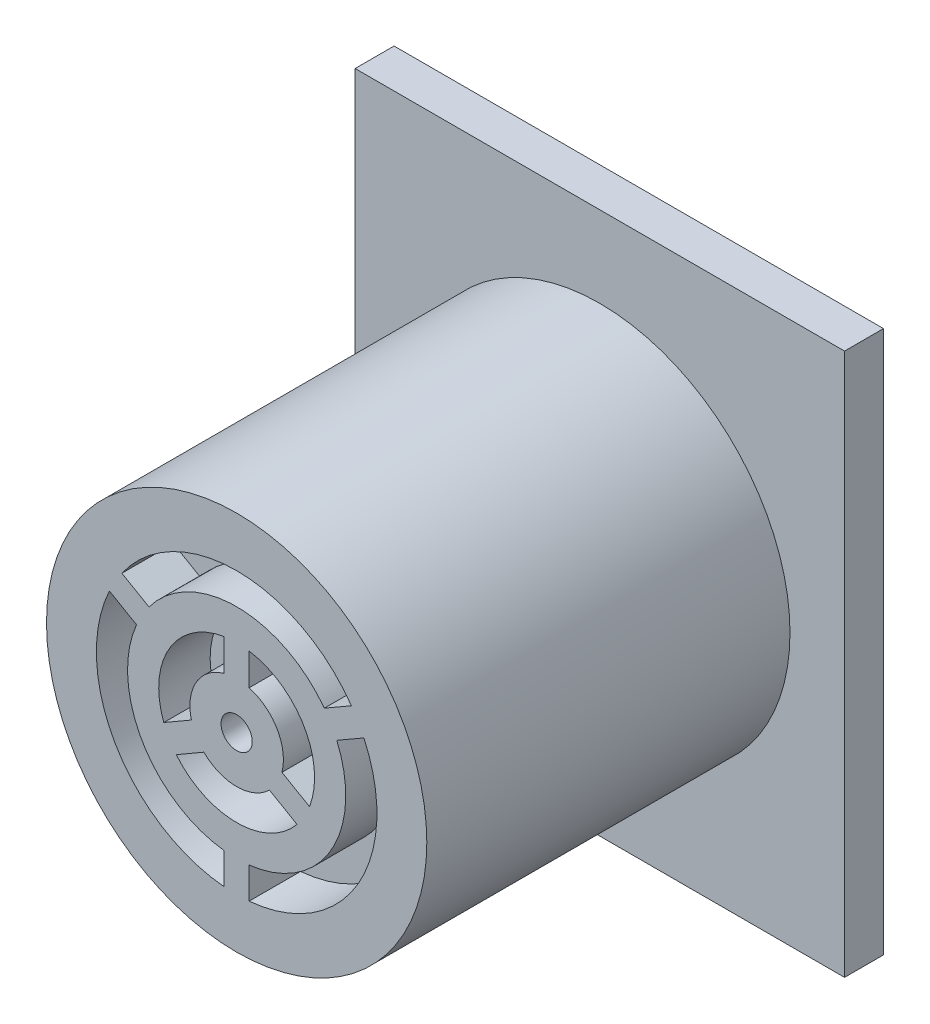
ISO-10303-21;
HEADER;
FILE_DESCRIPTION(('STEP AP214'),'2;1');
FILE_NAME('part.step','',(''),(''),'','','');
FILE_SCHEMA(('AUTOMOTIVE_DESIGN { 1 0 10303 214 1 1 1 1 }'));
ENDSEC;
DATA;
#1=APPLICATION_CONTEXT('core data for automotive mechanical design processes');
#2=APPLICATION_PROTOCOL_DEFINITION('international standard','automotive_design',2000,#1);
#3=PRODUCT_CONTEXT('',#1,'mechanical');
#4=PRODUCT('Part','Part','',(#3));
#5=PRODUCT_RELATED_PRODUCT_CATEGORY('part','',(#4));
#6=PRODUCT_DEFINITION_FORMATION('','',#4);
#7=PRODUCT_DEFINITION_CONTEXT('part definition',#1,'design');
#8=PRODUCT_DEFINITION('design','',#6,#7);
#9=PRODUCT_DEFINITION_SHAPE('','',#8);
#10=(LENGTH_UNIT() NAMED_UNIT(*) SI_UNIT(.MILLI.,.METRE.));
#11=(NAMED_UNIT(*) PLANE_ANGLE_UNIT() SI_UNIT($,.RADIAN.));
#12=(NAMED_UNIT(*) SI_UNIT($,.STERADIAN.) SOLID_ANGLE_UNIT());
#13=UNCERTAINTY_MEASURE_WITH_UNIT(LENGTH_MEASURE(1.E-05),#10,'distance_accuracy_value','');
#14=(GEOMETRIC_REPRESENTATION_CONTEXT(3) GLOBAL_UNCERTAINTY_ASSIGNED_CONTEXT((#13)) GLOBAL_UNIT_ASSIGNED_CONTEXT((#10,
#11,#12)) REPRESENTATION_CONTEXT('',''));
#15=CARTESIAN_POINT('',(0.,0.,0.));
#16=DIRECTION('',(0.,0.,1.));
#17=DIRECTION('',(1.,0.,0.));
#18=AXIS2_PLACEMENT_3D('',#15,#16,#17);
#19=CARTESIAN_POINT('',(0.,0.,16.383));
#20=DIRECTION('',(0.,0.,1.));
#21=DIRECTION('',(1.,0.,0.));
#22=AXIS2_PLACEMENT_3D('',#19,#20,#21);
#23=PLANE('',#22);
#24=CARTESIAN_POINT('',(0.,0.,16.383));
#25=DIRECTION('',(0.,0.,1.));
#26=DIRECTION('',(1.,0.,0.));
#27=AXIS2_PLACEMENT_3D('',#24,#25,#26);
#28=CIRCLE('',#27,7.747);
#29=CARTESIAN_POINT('',(7.747,0.,16.383));
#30=VERTEX_POINT('',#29);
#31=EDGE_CURVE('E13',#30,#30,#28,.T.);
#32=ORIENTED_EDGE('',*,*,#31,.T.);
#33=EDGE_LOOP('',(#32));
#34=FACE_BOUND('',#33,.T.);
#35=DIRECTION('',(0.866025403784437,0.500000000000003,0.));
#36=VECTOR('',#35,1.);
#37=CARTESIAN_POINT('',(-7.69524592699946,-3.85626443393688,16.383));
#38=LINE('',#37,#36);
#39=CARTESIAN_POINT('',(3.57026081092803,2.64787891376315,16.383));
#40=VERTEX_POINT('',#39);
#41=CARTESIAN_POINT('',(4.67574347709898,3.28612962866141,16.383));
#42=VERTEX_POINT('',#41);
#43=EDGE_CURVE('E561',#40,#42,#38,.T.);
#44=ORIENTED_EDGE('',*,*,#43,.F.);
#45=CARTESIAN_POINT('',(0.,0.,16.383));
#46=DIRECTION('',(0.,0.,1.));
#47=DIRECTION('',(1.,0.,0.));
#48=AXIS2_PLACEMENT_3D('',#45,#46,#47);
#49=CIRCLE('',#48,4.445);
#50=CARTESIAN_POINT('',(-3.57026081092802,2.64787891376316,16.383));
#51=VERTEX_POINT('',#50);
#52=EDGE_CURVE('E572',#40,#51,#49,.T.);
#53=ORIENTED_EDGE('',*,*,#52,.T.);
#54=DIRECTION('',(-0.866025403784435,0.500000000000006,0.));
#55=VECTOR('',#54,1.);
#56=CARTESIAN_POINT('',(7.69524592699949,-3.85626443393695,16.383));
#57=LINE('',#56,#55);
#58=CARTESIAN_POINT('',(-4.67574347709896,3.28612962866143,16.383));
#59=VERTEX_POINT('',#58);
#60=EDGE_CURVE('E584',#51,#59,#57,.T.);
#61=ORIENTED_EDGE('',*,*,#60,.T.);
#62=CARTESIAN_POINT('',(0.,0.,16.383));
#63=DIRECTION('',(0.,0.,1.));
#64=DIRECTION('',(1.,0.,0.));
#65=AXIS2_PLACEMENT_3D('',#62,#63,#64);
#66=CIRCLE('',#65,5.715);
#67=EDGE_CURVE('E581',#42,#59,#66,.T.);
#68=ORIENTED_EDGE('',*,*,#67,.F.);
#69=EDGE_LOOP('',(#44,#53,#61,#68));
#70=FACE_BOUND('',#69,.T.);
#71=DIRECTION('',(-0.866025403784435,0.500000000000006,0.));
#72=VECTOR('',#71,1.);
#73=CARTESIAN_POINT('',(7.18724592699949,-4.73614624418192,16.383));
#74=LINE('',#73,#72);
#75=CARTESIAN_POINT('',(-4.07826081092803,1.76799710351818,16.383));
#76=VERTEX_POINT('',#75);
#77=CARTESIAN_POINT('',(-5.18374347709897,2.40624781841644,16.383));
#78=VERTEX_POINT('',#77);
#79=EDGE_CURVE('E531',#76,#78,#74,.T.);
#80=ORIENTED_EDGE('',*,*,#79,.F.);
#81=CARTESIAN_POINT('',(0.,0.,16.383));
#82=DIRECTION('',(0.,0.,1.));
#83=DIRECTION('',(1.,0.,0.));
#84=AXIS2_PLACEMENT_3D('',#81,#82,#83);
#85=CIRCLE('',#84,4.445);
#86=CARTESIAN_POINT('',(-0.508000000000007,-4.41587601728128,16.383));
#87=VERTEX_POINT('',#86);
#88=EDGE_CURVE('E542',#76,#87,#85,.T.);
#89=ORIENTED_EDGE('',*,*,#88,.T.);
#90=DIRECTION('',(0.,-1.,0.));
#91=VECTOR('',#90,1.);
#92=CARTESIAN_POINT('',(-0.508000000000032,-17.1848213562373,16.383));
#93=LINE('',#92,#91);
#94=CARTESIAN_POINT('',(-0.50800000000001,-5.6923774470778,16.383));
#95=VERTEX_POINT('',#94);
#96=EDGE_CURVE('E554',#87,#95,#93,.T.);
#97=ORIENTED_EDGE('',*,*,#96,.T.);
#98=CARTESIAN_POINT('',(0.,0.,16.383));
#99=DIRECTION('',(0.,0.,1.));
#100=DIRECTION('',(1.,0.,0.));
#101=AXIS2_PLACEMENT_3D('',#98,#99,#100);
#102=CIRCLE('',#101,5.715);
#103=EDGE_CURVE('E551',#78,#95,#102,.T.);
#104=ORIENTED_EDGE('',*,*,#103,.F.);
#105=EDGE_LOOP('',(#80,#89,#97,#104));
#106=FACE_BOUND('',#105,.T.);
#107=DIRECTION('',(0.,1.,0.));
#108=VECTOR('',#107,1.);
#109=CARTESIAN_POINT('',(-0.508,-17.1848213562373,16.383));
#110=LINE('',#109,#108);
#111=CARTESIAN_POINT('',(-0.508,1.83601770143972,16.383));
#112=VERTEX_POINT('',#111);
#113=CARTESIAN_POINT('',(-0.508,3.13409652053028,16.383));
#114=VERTEX_POINT('',#113);
#115=EDGE_CURVE('E501',#112,#114,#110,.T.);
#116=ORIENTED_EDGE('',*,*,#115,.F.);
#117=CARTESIAN_POINT('',(0.,0.,16.383));
#118=DIRECTION('',(0.,0.,1.));
#119=DIRECTION('',(1.,0.,0.));
#120=AXIS2_PLACEMENT_3D('',#117,#118,#119);
#121=CIRCLE('',#120,1.905);
#122=CARTESIAN_POINT('',(-1.84403797124472,-0.47806794559735,16.383));
#123=VERTEX_POINT('',#122);
#124=EDGE_CURVE('E512',#112,#123,#121,.T.);
#125=ORIENTED_EDGE('',*,*,#124,.T.);
#126=DIRECTION('',(-0.866025403784439,-0.5,0.));
#127=VECTOR('',#126,1.);
#128=CARTESIAN_POINT('',(-7.69524592699944,-3.85626443393682,16.383));
#129=LINE('',#128,#127);
#130=CARTESIAN_POINT('',(-2.96820720469165,-1.12710735514263,16.383));
#131=VERTEX_POINT('',#130);
#132=EDGE_CURVE('E524',#123,#131,#129,.T.);
#133=ORIENTED_EDGE('',*,*,#132,.T.);
#134=CARTESIAN_POINT('',(0.,0.,16.383));
#135=DIRECTION('',(0.,0.,1.));
#136=DIRECTION('',(1.,0.,0.));
#137=AXIS2_PLACEMENT_3D('',#134,#135,#136);
#138=CIRCLE('',#137,3.175);
#139=EDGE_CURVE('E521',#114,#131,#138,.T.);
#140=ORIENTED_EDGE('',*,*,#139,.F.);
#141=EDGE_LOOP('',(#116,#125,#133,#140));
#142=FACE_BOUND('',#141,.T.);
#143=DIRECTION('',(-0.866025403784438,-0.5,0.));
#144=VECTOR('',#143,1.);
#145=CARTESIAN_POINT('',(-7.18724592699944,-4.73614624418181,16.383));
#146=LINE('',#145,#144);
#147=CARTESIAN_POINT('',(-1.33603797124473,-1.35794975584234,16.383));
#148=VERTEX_POINT('',#147);
#149=CARTESIAN_POINT('',(-2.46020720469165,-2.00698916538762,16.383));
#150=VERTEX_POINT('',#149);
#151=EDGE_CURVE('E475',#148,#150,#146,.T.);
#152=ORIENTED_EDGE('',*,*,#151,.F.);
#153=CARTESIAN_POINT('',(0.,0.,16.383));
#154=DIRECTION('',(0.,0.,1.));
#155=DIRECTION('',(1.,0.,0.));
#156=AXIS2_PLACEMENT_3D('',#153,#154,#155);
#157=CIRCLE('',#156,1.905);
#158=CARTESIAN_POINT('',(1.33603797124471,-1.35794975584236,16.383));
#159=VERTEX_POINT('',#158);
#160=EDGE_CURVE('E482',#148,#159,#157,.T.);
#161=ORIENTED_EDGE('',*,*,#160,.T.);
#162=DIRECTION('',(0.866025403784439,-0.5,0.));
#163=VECTOR('',#162,1.);
#164=CARTESIAN_POINT('',(7.18724592699943,-4.73614624418183,16.383));
#165=LINE('',#164,#163);
#166=CARTESIAN_POINT('',(2.46020720469163,-2.00698916538764,16.383));
#167=VERTEX_POINT('',#166);
#168=EDGE_CURVE('E494',#159,#167,#165,.T.);
#169=ORIENTED_EDGE('',*,*,#168,.T.);
#170=CARTESIAN_POINT('',(0.,0.,16.383));
#171=DIRECTION('',(0.,0.,1.));
#172=DIRECTION('',(1.,0.,0.));
#173=AXIS2_PLACEMENT_3D('',#170,#171,#172);
#174=CIRCLE('',#173,3.175);
#175=EDGE_CURVE('E491',#150,#167,#174,.T.);
#176=ORIENTED_EDGE('',*,*,#175,.F.);
#177=EDGE_LOOP('',(#152,#161,#169,#176));
#178=FACE_BOUND('',#177,.T.);
#179=CARTESIAN_POINT('',(0.,0.,16.383));
#180=DIRECTION('',(0.,0.,1.));
#181=DIRECTION('',(1.,0.,0.));
#182=AXIS2_PLACEMENT_3D('',#179,#180,#181);
#183=CIRCLE('',#182,0.635);
#184=CARTESIAN_POINT('',(0.635,0.,16.383));
#185=VERTEX_POINT('',#184);
#186=EDGE_CURVE('E466',#185,#185,#183,.T.);
#187=ORIENTED_EDGE('',*,*,#186,.F.);
#188=EDGE_LOOP('',(#187));
#189=FACE_BOUND('',#188,.T.);
#190=DIRECTION('',(0.866025403784439,-0.5,0.));
#191=VECTOR('',#190,1.);
#192=CARTESIAN_POINT('',(7.69524592699943,-3.85626443393684,16.383));
#193=LINE('',#192,#191);
#194=CARTESIAN_POINT('',(1.84403797124471,-0.478067945597378,16.383));
#195=VERTEX_POINT('',#194);
#196=CARTESIAN_POINT('',(2.96820720469163,-1.12710735514266,16.383));
#197=VERTEX_POINT('',#196);
#198=EDGE_CURVE('E267',#195,#197,#193,.T.);
#199=ORIENTED_EDGE('',*,*,#198,.F.);
#200=CARTESIAN_POINT('',(0.,0.,16.383));
#201=DIRECTION('',(0.,0.,1.));
#202=DIRECTION('',(1.,0.,0.));
#203=AXIS2_PLACEMENT_3D('',#200,#201,#202);
#204=CIRCLE('',#203,1.905);
#205=CARTESIAN_POINT('',(0.508,1.83601770143972,16.383));
#206=VERTEX_POINT('',#205);
#207=EDGE_CURVE('E447',#195,#206,#204,.T.);
#208=ORIENTED_EDGE('',*,*,#207,.T.);
#209=DIRECTION('',(0.,1.,0.));
#210=VECTOR('',#209,1.);
#211=CARTESIAN_POINT('',(0.508,-17.1848213562373,16.383));
#212=LINE('',#211,#210);
#213=CARTESIAN_POINT('',(0.508,3.13409652053028,16.383));
#214=VERTEX_POINT('',#213);
#215=EDGE_CURVE('E459',#206,#214,#212,.T.);
#216=ORIENTED_EDGE('',*,*,#215,.T.);
#217=CARTESIAN_POINT('',(0.,0.,16.383));
#218=DIRECTION('',(0.,0.,1.));
#219=DIRECTION('',(1.,0.,0.));
#220=AXIS2_PLACEMENT_3D('',#217,#218,#219);
#221=CIRCLE('',#220,3.175);
#222=EDGE_CURVE('E456',#197,#214,#221,.T.);
#223=ORIENTED_EDGE('',*,*,#222,.F.);
#224=EDGE_LOOP('',(#199,#208,#216,#223));
#225=FACE_BOUND('',#224,.T.);
#226=DIRECTION('',(0.,-1.,0.));
#227=VECTOR('',#226,1.);
#228=CARTESIAN_POINT('',(0.50799999999997,-17.1848213562373,16.383));
#229=LINE('',#228,#227);
#230=CARTESIAN_POINT('',(0.507999999999993,-4.41587601728128,16.383));
#231=VERTEX_POINT('',#230);
#232=CARTESIAN_POINT('',(0.507999999999991,-5.6923774470778,16.383));
#233=VERTEX_POINT('',#232);
#234=EDGE_CURVE('E431',#231,#233,#229,.T.);
#235=ORIENTED_EDGE('',*,*,#234,.F.);
#236=CARTESIAN_POINT('',(0.,0.,16.383));
#237=DIRECTION('',(0.,0.,1.));
#238=DIRECTION('',(1.,0.,0.));
#239=AXIS2_PLACEMENT_3D('',#236,#237,#238);
#240=CIRCLE('',#239,4.445);
#241=CARTESIAN_POINT('',(4.07826081092804,1.76799710351816,16.383));
#242=VERTEX_POINT('',#241);
#243=EDGE_CURVE('E259',#231,#242,#240,.T.);
#244=ORIENTED_EDGE('',*,*,#243,.T.);
#245=DIRECTION('',(0.866025403784437,0.500000000000002,0.));
#246=VECTOR('',#245,1.);
#247=CARTESIAN_POINT('',(-7.18724592699945,-4.73614624418186,16.383));
#248=LINE('',#247,#246);
#249=CARTESIAN_POINT('',(5.18374347709898,2.40624781841642,16.383));
#250=VERTEX_POINT('',#249);
#251=EDGE_CURVE('E421',#242,#250,#248,.T.);
#252=ORIENTED_EDGE('',*,*,#251,.T.);
#253=CARTESIAN_POINT('',(0.,0.,16.383));
#254=DIRECTION('',(0.,0.,1.));
#255=DIRECTION('',(1.,0.,0.));
#256=AXIS2_PLACEMENT_3D('',#253,#254,#255);
#257=CIRCLE('',#256,5.715);
#258=EDGE_CURVE('E433',#233,#250,#257,.T.);
#259=ORIENTED_EDGE('',*,*,#258,.F.);
#260=EDGE_LOOP('',(#235,#244,#252,#259));
#261=FACE_BOUND('',#260,.T.);
#262=ADVANCED_FACE('F244',(#34,#70,#106,#142,#178,#189,#225,#261),#23,.T.);
#263=CARTESIAN_POINT('',(0.,0.,16.383));
#264=DIRECTION('',(0.,0.,-1.));
#265=DIRECTION('',(-1.,0.,0.));
#266=AXIS2_PLACEMENT_3D('',#263,#264,#265);
#267=CYLINDRICAL_SURFACE('',#266,7.747);
#268=ORIENTED_EDGE('',*,*,#31,.F.);
#269=EDGE_LOOP('',(#268));
#270=FACE_BOUND('',#269,.T.);
#271=CARTESIAN_POINT('',(0.,0.,1.5875));
#272=DIRECTION('',(0.,0.,1.));
#273=DIRECTION('',(1.,0.,0.));
#274=AXIS2_PLACEMENT_3D('',#271,#272,#273);
#275=CIRCLE('',#274,7.747);
#276=CARTESIAN_POINT('',(7.747,0.,1.5875));
#277=VERTEX_POINT('',#276);
#278=EDGE_CURVE('E248',#277,#277,#275,.T.);
#279=ORIENTED_EDGE('',*,*,#278,.T.);
#280=EDGE_LOOP('',(#279));
#281=FACE_BOUND('',#280,.T.);
#282=ADVANCED_FACE('F246',(#270,#281),#267,.T.);
#283=CARTESIAN_POINT('',(0.,0.,1.5875));
#284=DIRECTION('',(0.,0.,1.));
#285=DIRECTION('',(1.,0.,0.));
#286=AXIS2_PLACEMENT_3D('',#283,#284,#285);
#287=PLANE('',#286);
#288=ORIENTED_EDGE('',*,*,#278,.F.);
#289=EDGE_LOOP('',(#288));
#290=FACE_BOUND('',#289,.T.);
#291=ADVANCED_FACE('F625',(#290),#287,.F.);
#292=CARTESIAN_POINT('',(-7.69524592699946,-3.85626443393688,14.2875));
#293=DIRECTION('',(0.500000000000003,-0.866025403784437,0.));
#294=DIRECTION('',(0.866025403784437,0.500000000000003,0.));
#295=AXIS2_PLACEMENT_3D('',#292,#293,#294);
#296=PLANE('',#295);
#297=ORIENTED_EDGE('',*,*,#43,.T.);
#298=DIRECTION('',(0.,0.,1.));
#299=VECTOR('',#298,1.);
#300=CARTESIAN_POINT('',(4.67574347709898,3.28612962866141,14.2875));
#301=LINE('',#300,#299);
#302=CARTESIAN_POINT('',(4.67574347709898,3.28612962866141,14.2875));
#303=VERTEX_POINT('',#302);
#304=EDGE_CURVE('E579',#303,#42,#301,.T.);
#305=ORIENTED_EDGE('',*,*,#304,.F.);
#306=DIRECTION('',(0.866025403784437,0.500000000000003,0.));
#307=VECTOR('',#306,1.);
#308=CARTESIAN_POINT('',(-7.69524592699946,-3.85626443393688,14.2875));
#309=LINE('',#308,#307);
#310=CARTESIAN_POINT('',(3.57026081092803,2.64787891376315,14.2875));
#311=VERTEX_POINT('',#310);
#312=EDGE_CURVE('E568',#311,#303,#309,.T.);
#313=ORIENTED_EDGE('',*,*,#312,.F.);
#314=DIRECTION('',(0.,0.,1.));
#315=VECTOR('',#314,1.);
#316=CARTESIAN_POINT('',(3.57026081092803,2.64787891376315,14.2875));
#317=LINE('',#316,#315);
#318=EDGE_CURVE('E589',#311,#40,#317,.T.);
#319=ORIENTED_EDGE('',*,*,#318,.T.);
#320=EDGE_LOOP('',(#297,#305,#313,#319));
#321=FACE_BOUND('',#320,.T.);
#322=ADVANCED_FACE('F615',(#321),#296,.F.);
#323=CARTESIAN_POINT('',(0.,0.,14.2875));
#324=DIRECTION('',(0.,0.,1.));
#325=DIRECTION('',(1.,0.,0.));
#326=AXIS2_PLACEMENT_3D('',#323,#324,#325);
#327=CYLINDRICAL_SURFACE('',#326,4.445);
#328=ORIENTED_EDGE('',*,*,#52,.F.);
#329=ORIENTED_EDGE('',*,*,#318,.F.);
#330=CARTESIAN_POINT('',(0.,0.,14.2875));
#331=DIRECTION('',(0.,0.,1.));
#332=DIRECTION('',(1.,0.,0.));
#333=AXIS2_PLACEMENT_3D('',#330,#331,#332);
#334=CIRCLE('',#333,4.445);
#335=CARTESIAN_POINT('',(-3.57026081092802,2.64787891376316,14.2875));
#336=VERTEX_POINT('',#335);
#337=EDGE_CURVE('E577',#311,#336,#334,.T.);
#338=ORIENTED_EDGE('',*,*,#337,.T.);
#339=DIRECTION('',(0.,0.,1.));
#340=VECTOR('',#339,1.);
#341=CARTESIAN_POINT('',(-3.57026081092802,2.64787891376316,14.2875));
#342=LINE('',#341,#340);
#343=EDGE_CURVE('E591',#336,#51,#342,.T.);
#344=ORIENTED_EDGE('',*,*,#343,.T.);
#345=EDGE_LOOP('',(#328,#329,#338,#344));
#346=FACE_BOUND('',#345,.T.);
#347=ADVANCED_FACE('F617',(#346),#327,.T.);
#348=CARTESIAN_POINT('',(7.69524592699949,-3.85626443393695,14.2875));
#349=DIRECTION('',(0.500000000000006,0.866025403784435,0.));
#350=DIRECTION('',(-0.866025403784435,0.500000000000006,0.));
#351=AXIS2_PLACEMENT_3D('',#348,#349,#350);
#352=PLANE('',#351);
#353=ORIENTED_EDGE('',*,*,#60,.F.);
#354=ORIENTED_EDGE('',*,*,#343,.F.);
#355=DIRECTION('',(-0.866025403784435,0.500000000000006,0.));
#356=VECTOR('',#355,1.);
#357=CARTESIAN_POINT('',(7.69524592699949,-3.85626443393695,14.2875));
#358=LINE('',#357,#356);
#359=CARTESIAN_POINT('',(-4.67574347709896,3.28612962866143,14.2875));
#360=VERTEX_POINT('',#359);
#361=EDGE_CURVE('E575',#336,#360,#358,.T.);
#362=ORIENTED_EDGE('',*,*,#361,.T.);
#363=DIRECTION('',(0.,0.,1.));
#364=VECTOR('',#363,1.);
#365=CARTESIAN_POINT('',(-4.67574347709896,3.28612962866143,14.2875));
#366=LINE('',#365,#364);
#367=EDGE_CURVE('E593',#360,#59,#366,.T.);
#368=ORIENTED_EDGE('',*,*,#367,.T.);
#369=EDGE_LOOP('',(#353,#354,#362,#368));
#370=FACE_BOUND('',#369,.T.);
#371=ADVANCED_FACE('F610',(#370),#352,.T.);
#372=CARTESIAN_POINT('',(0.,0.,14.2875));
#373=DIRECTION('',(0.,0.,1.));
#374=DIRECTION('',(1.,0.,0.));
#375=AXIS2_PLACEMENT_3D('',#372,#373,#374);
#376=CYLINDRICAL_SURFACE('',#375,5.715);
#377=ORIENTED_EDGE('',*,*,#67,.T.);
#378=ORIENTED_EDGE('',*,*,#367,.F.);
#379=CARTESIAN_POINT('',(0.,0.,14.2875));
#380=DIRECTION('',(0.,0.,1.));
#381=DIRECTION('',(1.,0.,0.));
#382=AXIS2_PLACEMENT_3D('',#379,#380,#381);
#383=CIRCLE('',#382,5.715);
#384=EDGE_CURVE('E571',#303,#360,#383,.T.);
#385=ORIENTED_EDGE('',*,*,#384,.F.);
#386=ORIENTED_EDGE('',*,*,#304,.T.);
#387=EDGE_LOOP('',(#377,#378,#385,#386));
#388=FACE_BOUND('',#387,.T.);
#389=ADVANCED_FACE('F599',(#388),#376,.F.);
#390=CARTESIAN_POINT('',(0.,-17.1848213562373,14.2875));
#391=DIRECTION('',(0.,0.,1.));
#392=DIRECTION('',(1.,0.,0.));
#393=AXIS2_PLACEMENT_3D('',#390,#391,#392);
#394=PLANE('',#393);
#395=ORIENTED_EDGE('',*,*,#312,.T.);
#396=ORIENTED_EDGE('',*,*,#384,.T.);
#397=ORIENTED_EDGE('',*,*,#361,.F.);
#398=ORIENTED_EDGE('',*,*,#337,.F.);
#399=EDGE_LOOP('',(#395,#396,#397,#398));
#400=FACE_BOUND('',#399,.T.);
#401=ADVANCED_FACE('F613',(#400),#394,.T.);
#402=CARTESIAN_POINT('',(7.18724592699949,-4.73614624418192,14.2875));
#403=DIRECTION('',(0.500000000000006,0.866025403784435,0.));
#404=DIRECTION('',(-0.866025403784435,0.500000000000006,0.));
#405=AXIS2_PLACEMENT_3D('',#402,#403,#404);
#406=PLANE('',#405);
#407=ORIENTED_EDGE('',*,*,#79,.T.);
#408=DIRECTION('',(0.,0.,1.));
#409=VECTOR('',#408,1.);
#410=CARTESIAN_POINT('',(-5.18374347709897,2.40624781841644,14.2875));
#411=LINE('',#410,#409);
#412=CARTESIAN_POINT('',(-5.18374347709897,2.40624781841644,14.2875));
#413=VERTEX_POINT('',#412);
#414=EDGE_CURVE('E549',#413,#78,#411,.T.);
#415=ORIENTED_EDGE('',*,*,#414,.F.);
#416=DIRECTION('',(-0.866025403784435,0.500000000000006,0.));
#417=VECTOR('',#416,1.);
#418=CARTESIAN_POINT('',(7.18724592699949,-4.73614624418192,14.2875));
#419=LINE('',#418,#417);
#420=CARTESIAN_POINT('',(-4.07826081092803,1.76799710351818,14.2875));
#421=VERTEX_POINT('',#420);
#422=EDGE_CURVE('E538',#421,#413,#419,.T.);
#423=ORIENTED_EDGE('',*,*,#422,.F.);
#424=DIRECTION('',(0.,0.,1.));
#425=VECTOR('',#424,1.);
#426=CARTESIAN_POINT('',(-4.07826081092803,1.76799710351818,14.2875));
#427=LINE('',#426,#425);
#428=EDGE_CURVE('E559',#421,#76,#427,.T.);
#429=ORIENTED_EDGE('',*,*,#428,.T.);
#430=EDGE_LOOP('',(#407,#415,#423,#429));
#431=FACE_BOUND('',#430,.T.);
#432=ADVANCED_FACE('F677',(#431),#406,.F.);
#433=CARTESIAN_POINT('',(0.,0.,14.2875));
#434=DIRECTION('',(0.,0.,1.));
#435=DIRECTION('',(1.,0.,0.));
#436=AXIS2_PLACEMENT_3D('',#433,#434,#435);
#437=CYLINDRICAL_SURFACE('',#436,4.445);
#438=ORIENTED_EDGE('',*,*,#88,.F.);
#439=ORIENTED_EDGE('',*,*,#428,.F.);
#440=CARTESIAN_POINT('',(0.,0.,14.2875));
#441=DIRECTION('',(0.,0.,1.));
#442=DIRECTION('',(1.,0.,0.));
#443=AXIS2_PLACEMENT_3D('',#440,#441,#442);
#444=CIRCLE('',#443,4.445);
#445=CARTESIAN_POINT('',(-0.508000000000007,-4.41587601728128,14.2875));
#446=VERTEX_POINT('',#445);
#447=EDGE_CURVE('E547',#421,#446,#444,.T.);
#448=ORIENTED_EDGE('',*,*,#447,.T.);
#449=DIRECTION('',(0.,0.,1.));
#450=VECTOR('',#449,1.);
#451=CARTESIAN_POINT('',(-0.508000000000007,-4.41587601728128,14.2875));
#452=LINE('',#451,#450);
#453=EDGE_CURVE('E562',#446,#87,#452,.T.);
#454=ORIENTED_EDGE('',*,*,#453,.T.);
#455=EDGE_LOOP('',(#438,#439,#448,#454));
#456=FACE_BOUND('',#455,.T.);
#457=ADVANCED_FACE('F685',(#456),#437,.T.);
#458=CARTESIAN_POINT('',(-0.508000000000032,-17.1848213562373,14.2875));
#459=DIRECTION('',(-1.,0.,0.));
#460=DIRECTION('',(0.,-1.,0.));
#461=AXIS2_PLACEMENT_3D('',#458,#459,#460);
#462=PLANE('',#461);
#463=ORIENTED_EDGE('',*,*,#96,.F.);
#464=ORIENTED_EDGE('',*,*,#453,.F.);
#465=DIRECTION('',(0.,-1.,0.));
#466=VECTOR('',#465,1.);
#467=CARTESIAN_POINT('',(-0.508000000000032,-17.1848213562373,14.2875));
#468=LINE('',#467,#466);
#469=CARTESIAN_POINT('',(-0.50800000000001,-5.6923774470778,14.2875));
#470=VERTEX_POINT('',#469);
#471=EDGE_CURVE('E545',#446,#470,#468,.T.);
#472=ORIENTED_EDGE('',*,*,#471,.T.);
#473=DIRECTION('',(0.,0.,1.));
#474=VECTOR('',#473,1.);
#475=CARTESIAN_POINT('',(-0.50800000000001,-5.6923774470778,14.2875));
#476=LINE('',#475,#474);
#477=EDGE_CURVE('E564',#470,#95,#476,.T.);
#478=ORIENTED_EDGE('',*,*,#477,.T.);
#479=EDGE_LOOP('',(#463,#464,#472,#478));
#480=FACE_BOUND('',#479,.T.);
#481=ADVANCED_FACE('F695',(#480),#462,.T.);
#482=CARTESIAN_POINT('',(0.,0.,14.2875));
#483=DIRECTION('',(0.,0.,1.));
#484=DIRECTION('',(1.,0.,0.));
#485=AXIS2_PLACEMENT_3D('',#482,#483,#484);
#486=CYLINDRICAL_SURFACE('',#485,5.715);
#487=ORIENTED_EDGE('',*,*,#103,.T.);
#488=ORIENTED_EDGE('',*,*,#477,.F.);
#489=CARTESIAN_POINT('',(0.,0.,14.2875));
#490=DIRECTION('',(0.,0.,1.));
#491=DIRECTION('',(1.,0.,0.));
#492=AXIS2_PLACEMENT_3D('',#489,#490,#491);
#493=CIRCLE('',#492,5.715);
#494=EDGE_CURVE('E541',#413,#470,#493,.T.);
#495=ORIENTED_EDGE('',*,*,#494,.F.);
#496=ORIENTED_EDGE('',*,*,#414,.T.);
#497=EDGE_LOOP('',(#487,#488,#495,#496));
#498=FACE_BOUND('',#497,.T.);
#499=ADVANCED_FACE('F705',(#498),#486,.F.);
#500=CARTESIAN_POINT('',(0.,-17.1848213562373,14.2875));
#501=DIRECTION('',(0.,0.,1.));
#502=DIRECTION('',(1.,0.,0.));
#503=AXIS2_PLACEMENT_3D('',#500,#501,#502);
#504=PLANE('',#503);
#505=ORIENTED_EDGE('',*,*,#422,.T.);
#506=ORIENTED_EDGE('',*,*,#494,.T.);
#507=ORIENTED_EDGE('',*,*,#471,.F.);
#508=ORIENTED_EDGE('',*,*,#447,.F.);
#509=EDGE_LOOP('',(#505,#506,#507,#508));
#510=FACE_BOUND('',#509,.T.);
#511=ADVANCED_FACE('F715',(#510),#504,.T.);
#512=CARTESIAN_POINT('',(-0.508,-17.1848213562373,14.2875));
#513=DIRECTION('',(1.,0.,0.));
#514=DIRECTION('',(0.,0.,-1.));
#515=AXIS2_PLACEMENT_3D('',#512,#513,#514);
#516=PLANE('',#515);
#517=ORIENTED_EDGE('',*,*,#115,.T.);
#518=DIRECTION('',(0.,0.,1.));
#519=VECTOR('',#518,1.);
#520=CARTESIAN_POINT('',(-0.508,3.13409652053028,14.2875));
#521=LINE('',#520,#519);
#522=CARTESIAN_POINT('',(-0.508,3.13409652053028,14.2875));
#523=VERTEX_POINT('',#522);
#524=EDGE_CURVE('E519',#523,#114,#521,.T.);
#525=ORIENTED_EDGE('',*,*,#524,.F.);
#526=DIRECTION('',(0.,1.,0.));
#527=VECTOR('',#526,1.);
#528=CARTESIAN_POINT('',(-0.508,-17.1848213562373,14.2875));
#529=LINE('',#528,#527);
#530=CARTESIAN_POINT('',(-0.508,1.83601770143972,14.2875));
#531=VERTEX_POINT('',#530);
#532=EDGE_CURVE('E508',#531,#523,#529,.T.);
#533=ORIENTED_EDGE('',*,*,#532,.F.);
#534=DIRECTION('',(0.,0.,1.));
#535=VECTOR('',#534,1.);
#536=CARTESIAN_POINT('',(-0.508,1.83601770143972,14.2875));
#537=LINE('',#536,#535);
#538=EDGE_CURVE('E529',#531,#112,#537,.T.);
#539=ORIENTED_EDGE('',*,*,#538,.T.);
#540=EDGE_LOOP('',(#517,#525,#533,#539));
#541=FACE_BOUND('',#540,.T.);
#542=ADVANCED_FACE('F725',(#541),#516,.F.);
#543=CARTESIAN_POINT('',(0.,0.,14.2875));
#544=DIRECTION('',(0.,0.,1.));
#545=DIRECTION('',(1.,0.,0.));
#546=AXIS2_PLACEMENT_3D('',#543,#544,#545);
#547=CYLINDRICAL_SURFACE('',#546,1.905);
#548=ORIENTED_EDGE('',*,*,#124,.F.);
#549=ORIENTED_EDGE('',*,*,#538,.F.);
#550=CARTESIAN_POINT('',(0.,0.,14.2875));
#551=DIRECTION('',(0.,0.,1.));
#552=DIRECTION('',(1.,0.,0.));
#553=AXIS2_PLACEMENT_3D('',#550,#551,#552);
#554=CIRCLE('',#553,1.905);
#555=CARTESIAN_POINT('',(-1.84403797124472,-0.47806794559735,14.2875));
#556=VERTEX_POINT('',#555);
#557=EDGE_CURVE('E517',#531,#556,#554,.T.);
#558=ORIENTED_EDGE('',*,*,#557,.T.);
#559=DIRECTION('',(0.,0.,1.));
#560=VECTOR('',#559,1.);
#561=CARTESIAN_POINT('',(-1.84403797124472,-0.47806794559735,14.2875));
#562=LINE('',#561,#560);
#563=EDGE_CURVE('E532',#556,#123,#562,.T.);
#564=ORIENTED_EDGE('',*,*,#563,.T.);
#565=EDGE_LOOP('',(#548,#549,#558,#564));
#566=FACE_BOUND('',#565,.T.);
#567=ADVANCED_FACE('F735',(#566),#547,.T.);
#568=CARTESIAN_POINT('',(-7.69524592699944,-3.85626443393682,14.2875));
#569=DIRECTION('',(-0.5,0.866025403784439,0.));
#570=DIRECTION('',(-0.866025403784439,-0.5,0.));
#571=AXIS2_PLACEMENT_3D('',#568,#569,#570);
#572=PLANE('',#571);
#573=ORIENTED_EDGE('',*,*,#132,.F.);
#574=ORIENTED_EDGE('',*,*,#563,.F.);
#575=DIRECTION('',(-0.866025403784439,-0.5,0.));
#576=VECTOR('',#575,1.);
#577=CARTESIAN_POINT('',(-7.69524592699944,-3.85626443393682,14.2875));
#578=LINE('',#577,#576);
#579=CARTESIAN_POINT('',(-2.96820720469165,-1.12710735514263,14.2875));
#580=VERTEX_POINT('',#579);
#581=EDGE_CURVE('E515',#556,#580,#578,.T.);
#582=ORIENTED_EDGE('',*,*,#581,.T.);
#583=DIRECTION('',(0.,0.,1.));
#584=VECTOR('',#583,1.);
#585=CARTESIAN_POINT('',(-2.96820720469165,-1.12710735514263,14.2875));
#586=LINE('',#585,#584);
#587=EDGE_CURVE('E534',#580,#131,#586,.T.);
#588=ORIENTED_EDGE('',*,*,#587,.T.);
#589=EDGE_LOOP('',(#573,#574,#582,#588));
#590=FACE_BOUND('',#589,.T.);
#591=ADVANCED_FACE('F745',(#590),#572,.T.);
#592=CARTESIAN_POINT('',(0.,0.,14.2875));
#593=DIRECTION('',(0.,0.,1.));
#594=DIRECTION('',(1.,0.,0.));
#595=AXIS2_PLACEMENT_3D('',#592,#593,#594);
#596=CYLINDRICAL_SURFACE('',#595,3.175);
#597=ORIENTED_EDGE('',*,*,#139,.T.);
#598=ORIENTED_EDGE('',*,*,#587,.F.);
#599=CARTESIAN_POINT('',(0.,0.,14.2875));
#600=DIRECTION('',(0.,0.,1.));
#601=DIRECTION('',(1.,0.,0.));
#602=AXIS2_PLACEMENT_3D('',#599,#600,#601);
#603=CIRCLE('',#602,3.175);
#604=EDGE_CURVE('E511',#523,#580,#603,.T.);
#605=ORIENTED_EDGE('',*,*,#604,.F.);
#606=ORIENTED_EDGE('',*,*,#524,.T.);
#607=EDGE_LOOP('',(#597,#598,#605,#606));
#608=FACE_BOUND('',#607,.T.);
#609=ADVANCED_FACE('F755',(#608),#596,.F.);
#610=CARTESIAN_POINT('',(0.,-17.1848213562373,14.2875));
#611=DIRECTION('',(0.,0.,1.));
#612=DIRECTION('',(1.,0.,0.));
#613=AXIS2_PLACEMENT_3D('',#610,#611,#612);
#614=PLANE('',#613);
#615=ORIENTED_EDGE('',*,*,#532,.T.);
#616=ORIENTED_EDGE('',*,*,#604,.T.);
#617=ORIENTED_EDGE('',*,*,#581,.F.);
#618=ORIENTED_EDGE('',*,*,#557,.F.);
#619=EDGE_LOOP('',(#615,#616,#617,#618));
#620=FACE_BOUND('',#619,.T.);
#621=ADVANCED_FACE('F765',(#620),#614,.T.);
#622=CARTESIAN_POINT('',(-7.18724592699944,-4.73614624418181,14.2875));
#623=DIRECTION('',(-0.5,0.866025403784438,0.));
#624=DIRECTION('',(-0.866025403784438,-0.5,0.));
#625=AXIS2_PLACEMENT_3D('',#622,#623,#624);
#626=PLANE('',#625);
#627=ORIENTED_EDGE('',*,*,#151,.T.);
#628=DIRECTION('',(0.,0.,1.));
#629=VECTOR('',#628,1.);
#630=CARTESIAN_POINT('',(-2.46020720469165,-2.00698916538762,14.2875));
#631=LINE('',#630,#629);
#632=CARTESIAN_POINT('',(-2.46020720469165,-2.00698916538762,14.2875));
#633=VERTEX_POINT('',#632);
#634=EDGE_CURVE('E489',#633,#150,#631,.T.);
#635=ORIENTED_EDGE('',*,*,#634,.F.);
#636=DIRECTION('',(-0.866025403784438,-0.5,0.));
#637=VECTOR('',#636,1.);
#638=CARTESIAN_POINT('',(-7.18724592699944,-4.73614624418181,14.2875));
#639=LINE('',#638,#637);
#640=CARTESIAN_POINT('',(-1.33603797124473,-1.35794975584234,14.2875));
#641=VERTEX_POINT('',#640);
#642=EDGE_CURVE('E478',#641,#633,#639,.T.);
#643=ORIENTED_EDGE('',*,*,#642,.F.);
#644=DIRECTION('',(0.,0.,1.));
#645=VECTOR('',#644,1.);
#646=CARTESIAN_POINT('',(-1.33603797124473,-1.35794975584234,14.2875));
#647=LINE('',#646,#645);
#648=EDGE_CURVE('E499',#641,#148,#647,.T.);
#649=ORIENTED_EDGE('',*,*,#648,.T.);
#650=EDGE_LOOP('',(#627,#635,#643,#649));
#651=FACE_BOUND('',#650,.T.);
#652=ADVANCED_FACE('F775',(#651),#626,.F.);
#653=CARTESIAN_POINT('',(0.,0.,14.2875));
#654=DIRECTION('',(0.,0.,1.));
#655=DIRECTION('',(1.,0.,0.));
#656=AXIS2_PLACEMENT_3D('',#653,#654,#655);
#657=CYLINDRICAL_SURFACE('',#656,1.905);
#658=ORIENTED_EDGE('',*,*,#160,.F.);
#659=ORIENTED_EDGE('',*,*,#648,.F.);
#660=CARTESIAN_POINT('',(0.,0.,14.2875));
#661=DIRECTION('',(0.,0.,1.));
#662=DIRECTION('',(1.,0.,0.));
#663=AXIS2_PLACEMENT_3D('',#660,#661,#662);
#664=CIRCLE('',#663,1.905);
#665=CARTESIAN_POINT('',(1.33603797124471,-1.35794975584236,14.2875));
#666=VERTEX_POINT('',#665);
#667=EDGE_CURVE('E487',#641,#666,#664,.T.);
#668=ORIENTED_EDGE('',*,*,#667,.T.);
#669=DIRECTION('',(0.,0.,1.));
#670=VECTOR('',#669,1.);
#671=CARTESIAN_POINT('',(1.33603797124471,-1.35794975584236,14.2875));
#672=LINE('',#671,#670);
#673=EDGE_CURVE('E502',#666,#159,#672,.T.);
#674=ORIENTED_EDGE('',*,*,#673,.T.);
#675=EDGE_LOOP('',(#658,#659,#668,#674));
#676=FACE_BOUND('',#675,.T.);
#677=ADVANCED_FACE('F785',(#676),#657,.T.);
#678=CARTESIAN_POINT('',(7.18724592699943,-4.73614624418183,14.2875));
#679=DIRECTION('',(-0.5,-0.866025403784439,0.));
#680=DIRECTION('',(0.866025403784439,-0.5,0.));
#681=AXIS2_PLACEMENT_3D('',#678,#679,#680);
#682=PLANE('',#681);
#683=ORIENTED_EDGE('',*,*,#168,.F.);
#684=ORIENTED_EDGE('',*,*,#673,.F.);
#685=DIRECTION('',(0.866025403784439,-0.5,0.));
#686=VECTOR('',#685,1.);
#687=CARTESIAN_POINT('',(7.18724592699943,-4.73614624418183,14.2875));
#688=LINE('',#687,#686);
#689=CARTESIAN_POINT('',(2.46020720469163,-2.00698916538764,14.2875));
#690=VERTEX_POINT('',#689);
#691=EDGE_CURVE('E485',#666,#690,#688,.T.);
#692=ORIENTED_EDGE('',*,*,#691,.T.);
#693=DIRECTION('',(0.,0.,1.));
#694=VECTOR('',#693,1.);
#695=CARTESIAN_POINT('',(2.46020720469163,-2.00698916538764,14.2875));
#696=LINE('',#695,#694);
#697=EDGE_CURVE('E504',#690,#167,#696,.T.);
#698=ORIENTED_EDGE('',*,*,#697,.T.);
#699=EDGE_LOOP('',(#683,#684,#692,#698));
#700=FACE_BOUND('',#699,.T.);
#701=ADVANCED_FACE('F795',(#700),#682,.T.);
#702=CARTESIAN_POINT('',(0.,0.,14.2875));
#703=DIRECTION('',(0.,0.,1.));
#704=DIRECTION('',(1.,0.,0.));
#705=AXIS2_PLACEMENT_3D('',#702,#703,#704);
#706=CYLINDRICAL_SURFACE('',#705,3.175);
#707=ORIENTED_EDGE('',*,*,#175,.T.);
#708=ORIENTED_EDGE('',*,*,#697,.F.);
#709=CARTESIAN_POINT('',(0.,0.,14.2875));
#710=DIRECTION('',(0.,0.,1.));
#711=DIRECTION('',(1.,0.,0.));
#712=AXIS2_PLACEMENT_3D('',#709,#710,#711);
#713=CIRCLE('',#712,3.175);
#714=EDGE_CURVE('E481',#633,#690,#713,.T.);
#715=ORIENTED_EDGE('',*,*,#714,.F.);
#716=ORIENTED_EDGE('',*,*,#634,.T.);
#717=EDGE_LOOP('',(#707,#708,#715,#716));
#718=FACE_BOUND('',#717,.T.);
#719=ADVANCED_FACE('F805',(#718),#706,.F.);
#720=CARTESIAN_POINT('',(0.,-17.1848213562373,14.2875));
#721=DIRECTION('',(0.,0.,1.));
#722=DIRECTION('',(1.,0.,0.));
#723=AXIS2_PLACEMENT_3D('',#720,#721,#722);
#724=PLANE('',#723);
#725=ORIENTED_EDGE('',*,*,#642,.T.);
#726=ORIENTED_EDGE('',*,*,#714,.T.);
#727=ORIENTED_EDGE('',*,*,#691,.F.);
#728=ORIENTED_EDGE('',*,*,#667,.F.);
#729=EDGE_LOOP('',(#725,#726,#727,#728));
#730=FACE_BOUND('',#729,.T.);
#731=ADVANCED_FACE('F815',(#730),#724,.T.);
#732=CARTESIAN_POINT('',(0.,0.,14.2875));
#733=DIRECTION('',(0.,0.,1.));
#734=DIRECTION('',(1.,0.,0.));
#735=AXIS2_PLACEMENT_3D('',#732,#733,#734);
#736=CYLINDRICAL_SURFACE('',#735,0.635);
#737=CARTESIAN_POINT('',(0.,0.,14.2875));
#738=DIRECTION('',(0.,0.,1.));
#739=DIRECTION('',(1.,0.,0.));
#740=AXIS2_PLACEMENT_3D('',#737,#738,#739);
#741=CIRCLE('',#740,0.635);
#742=CARTESIAN_POINT('',(0.635,0.,14.2875));
#743=VERTEX_POINT('',#742);
#744=EDGE_CURVE('E472',#743,#743,#741,.T.);
#745=ORIENTED_EDGE('',*,*,#744,.F.);
#746=EDGE_LOOP('',(#745));
#747=FACE_BOUND('',#746,.T.);
#748=ORIENTED_EDGE('',*,*,#186,.T.);
#749=EDGE_LOOP('',(#748));
#750=FACE_BOUND('',#749,.T.);
#751=ADVANCED_FACE('F825',(#747,#750),#736,.F.);
#752=CARTESIAN_POINT('',(0.,-17.1848213562373,14.2875));
#753=DIRECTION('',(0.,0.,1.));
#754=DIRECTION('',(1.,0.,0.));
#755=AXIS2_PLACEMENT_3D('',#752,#753,#754);
#756=PLANE('',#755);
#757=ORIENTED_EDGE('',*,*,#744,.T.);
#758=EDGE_LOOP('',(#757));
#759=FACE_BOUND('',#758,.T.);
#760=ADVANCED_FACE('F835',(#759),#756,.T.);
#761=CARTESIAN_POINT('',(7.69524592699943,-3.85626443393684,14.2875));
#762=DIRECTION('',(-0.5,-0.866025403784439,0.));
#763=DIRECTION('',(0.866025403784439,-0.5,0.));
#764=AXIS2_PLACEMENT_3D('',#761,#762,#763);
#765=PLANE('',#764);
#766=ORIENTED_EDGE('',*,*,#198,.T.);
#767=DIRECTION('',(0.,0.,1.));
#768=VECTOR('',#767,1.);
#769=CARTESIAN_POINT('',(2.96820720469164,-1.12710735514266,14.2875));
#770=LINE('',#769,#768);
#771=CARTESIAN_POINT('',(2.96820720469164,-1.12710735514266,14.2875));
#772=VERTEX_POINT('',#771);
#773=EDGE_CURVE('E454',#772,#197,#770,.T.);
#774=ORIENTED_EDGE('',*,*,#773,.F.);
#775=DIRECTION('',(0.866025403784439,-0.5,0.));
#776=VECTOR('',#775,1.);
#777=CARTESIAN_POINT('',(7.69524592699943,-3.85626443393684,14.2875));
#778=LINE('',#777,#776);
#779=CARTESIAN_POINT('',(1.84403797124471,-0.478067945597378,14.2875));
#780=VERTEX_POINT('',#779);
#781=EDGE_CURVE('E443',#780,#772,#778,.T.);
#782=ORIENTED_EDGE('',*,*,#781,.F.);
#783=DIRECTION('',(0.,0.,1.));
#784=VECTOR('',#783,1.);
#785=CARTESIAN_POINT('',(1.84403797124471,-0.478067945597378,14.2875));
#786=LINE('',#785,#784);
#787=EDGE_CURVE('E464',#780,#195,#786,.T.);
#788=ORIENTED_EDGE('',*,*,#787,.T.);
#789=EDGE_LOOP('',(#766,#774,#782,#788));
#790=FACE_BOUND('',#789,.T.);
#791=ADVANCED_FACE('F845',(#790),#765,.F.);
#792=CARTESIAN_POINT('',(0.,0.,14.2875));
#793=DIRECTION('',(0.,0.,1.));
#794=DIRECTION('',(1.,0.,0.));
#795=AXIS2_PLACEMENT_3D('',#792,#793,#794);
#796=CYLINDRICAL_SURFACE('',#795,1.905);
#797=ORIENTED_EDGE('',*,*,#207,.F.);
#798=ORIENTED_EDGE('',*,*,#787,.F.);
#799=CARTESIAN_POINT('',(0.,0.,14.2875));
#800=DIRECTION('',(0.,0.,1.));
#801=DIRECTION('',(1.,0.,0.));
#802=AXIS2_PLACEMENT_3D('',#799,#800,#801);
#803=CIRCLE('',#802,1.905);
#804=CARTESIAN_POINT('',(0.508,1.83601770143972,14.2875));
#805=VERTEX_POINT('',#804);
#806=EDGE_CURVE('E452',#780,#805,#803,.T.);
#807=ORIENTED_EDGE('',*,*,#806,.T.);
#808=DIRECTION('',(0.,0.,1.));
#809=VECTOR('',#808,1.);
#810=CARTESIAN_POINT('',(0.508,1.83601770143972,14.2875));
#811=LINE('',#810,#809);
#812=EDGE_CURVE('E467',#805,#206,#811,.T.);
#813=ORIENTED_EDGE('',*,*,#812,.T.);
#814=EDGE_LOOP('',(#797,#798,#807,#813));
#815=FACE_BOUND('',#814,.T.);
#816=ADVANCED_FACE('F855',(#815),#796,.T.);
#817=CARTESIAN_POINT('',(0.508,-17.1848213562373,14.2875));
#818=DIRECTION('',(1.,0.,0.));
#819=DIRECTION('',(0.,0.,-1.));
#820=AXIS2_PLACEMENT_3D('',#817,#818,#819);
#821=PLANE('',#820);
#822=ORIENTED_EDGE('',*,*,#215,.F.);
#823=ORIENTED_EDGE('',*,*,#812,.F.);
#824=DIRECTION('',(0.,1.,0.));
#825=VECTOR('',#824,1.);
#826=CARTESIAN_POINT('',(0.508,-17.1848213562373,14.2875));
#827=LINE('',#826,#825);
#828=CARTESIAN_POINT('',(0.508,3.13409652053028,14.2875));
#829=VERTEX_POINT('',#828);
#830=EDGE_CURVE('E450',#805,#829,#827,.T.);
#831=ORIENTED_EDGE('',*,*,#830,.T.);
#832=DIRECTION('',(0.,0.,1.));
#833=VECTOR('',#832,1.);
#834=CARTESIAN_POINT('',(0.508,3.13409652053028,14.2875));
#835=LINE('',#834,#833);
#836=EDGE_CURVE('E469',#829,#214,#835,.T.);
#837=ORIENTED_EDGE('',*,*,#836,.T.);
#838=EDGE_LOOP('',(#822,#823,#831,#837));
#839=FACE_BOUND('',#838,.T.);
#840=ADVANCED_FACE('F864',(#839),#821,.T.);
#841=CARTESIAN_POINT('',(0.,0.,14.2875));
#842=DIRECTION('',(0.,0.,1.));
#843=DIRECTION('',(1.,0.,0.));
#844=AXIS2_PLACEMENT_3D('',#841,#842,#843);
#845=CYLINDRICAL_SURFACE('',#844,3.175);
#846=ORIENTED_EDGE('',*,*,#222,.T.);
#847=ORIENTED_EDGE('',*,*,#836,.F.);
#848=CARTESIAN_POINT('',(0.,0.,14.2875));
#849=DIRECTION('',(0.,0.,1.));
#850=DIRECTION('',(1.,0.,0.));
#851=AXIS2_PLACEMENT_3D('',#848,#849,#850);
#852=CIRCLE('',#851,3.175);
#853=EDGE_CURVE('E446',#772,#829,#852,.T.);
#854=ORIENTED_EDGE('',*,*,#853,.F.);
#855=ORIENTED_EDGE('',*,*,#773,.T.);
#856=EDGE_LOOP('',(#846,#847,#854,#855));
#857=FACE_BOUND('',#856,.T.);
#858=ADVANCED_FACE('F874',(#857),#845,.F.);
#859=CARTESIAN_POINT('',(0.,-17.1848213562373,14.2875));
#860=DIRECTION('',(0.,0.,1.));
#861=DIRECTION('',(1.,0.,0.));
#862=AXIS2_PLACEMENT_3D('',#859,#860,#861);
#863=PLANE('',#862);
#864=ORIENTED_EDGE('',*,*,#781,.T.);
#865=ORIENTED_EDGE('',*,*,#853,.T.);
#866=ORIENTED_EDGE('',*,*,#830,.F.);
#867=ORIENTED_EDGE('',*,*,#806,.F.);
#868=EDGE_LOOP('',(#864,#865,#866,#867));
#869=FACE_BOUND('',#868,.T.);
#870=ADVANCED_FACE('F884',(#869),#863,.T.);
#871=CARTESIAN_POINT('',(0.,0.,14.2875));
#872=DIRECTION('',(0.,0.,1.));
#873=DIRECTION('',(1.,0.,0.));
#874=AXIS2_PLACEMENT_3D('',#871,#872,#873);
#875=CYLINDRICAL_SURFACE('',#874,4.445);
#876=ORIENTED_EDGE('',*,*,#243,.F.);
#877=DIRECTION('',(0.,0.,1.));
#878=VECTOR('',#877,1.);
#879=CARTESIAN_POINT('',(0.507999999999993,-4.41587601728128,14.2875));
#880=LINE('',#879,#878);
#881=CARTESIAN_POINT('',(0.507999999999993,-4.41587601728128,14.2875));
#882=VERTEX_POINT('',#881);
#883=EDGE_CURVE('E404',#882,#231,#880,.T.);
#884=ORIENTED_EDGE('',*,*,#883,.F.);
#885=CARTESIAN_POINT('',(0.,0.,14.2875));
#886=DIRECTION('',(0.,0.,1.));
#887=DIRECTION('',(1.,0.,0.));
#888=AXIS2_PLACEMENT_3D('',#885,#886,#887);
#889=CIRCLE('',#888,4.445);
#890=CARTESIAN_POINT('',(4.07826081092804,1.76799710351816,14.2875));
#891=VERTEX_POINT('',#890);
#892=EDGE_CURVE('E407',#882,#891,#889,.T.);
#893=ORIENTED_EDGE('',*,*,#892,.T.);
#894=DIRECTION('',(0.,0.,1.));
#895=VECTOR('',#894,1.);
#896=CARTESIAN_POINT('',(4.07826081092804,1.76799710351816,14.2875));
#897=LINE('',#896,#895);
#898=EDGE_CURVE('E438',#891,#242,#897,.T.);
#899=ORIENTED_EDGE('',*,*,#898,.T.);
#900=EDGE_LOOP('',(#876,#884,#893,#899));
#901=FACE_BOUND('',#900,.T.);
#902=ADVANCED_FACE('F406',(#901),#875,.T.);
#903=CARTESIAN_POINT('',(-7.18724592699945,-4.73614624418186,14.2875));
#904=DIRECTION('',(0.500000000000002,-0.866025403784437,0.));
#905=DIRECTION('',(0.866025403784437,0.500000000000002,0.));
#906=AXIS2_PLACEMENT_3D('',#903,#904,#905);
#907=PLANE('',#906);
#908=ORIENTED_EDGE('',*,*,#251,.F.);
#909=ORIENTED_EDGE('',*,*,#898,.F.);
#910=DIRECTION('',(0.866025403784437,0.500000000000002,0.));
#911=VECTOR('',#910,1.);
#912=CARTESIAN_POINT('',(-7.18724592699945,-4.73614624418186,14.2875));
#913=LINE('',#912,#911);
#914=CARTESIAN_POINT('',(5.18374347709898,2.40624781841642,14.2875));
#915=VERTEX_POINT('',#914);
#916=EDGE_CURVE('E414',#891,#915,#913,.T.);
#917=ORIENTED_EDGE('',*,*,#916,.T.);
#918=DIRECTION('',(0.,0.,1.));
#919=VECTOR('',#918,1.);
#920=CARTESIAN_POINT('',(5.18374347709898,2.40624781841642,14.2875));
#921=LINE('',#920,#919);
#922=EDGE_CURVE('E440',#915,#250,#921,.T.);
#923=ORIENTED_EDGE('',*,*,#922,.T.);
#924=EDGE_LOOP('',(#908,#909,#917,#923));
#925=FACE_BOUND('',#924,.T.);
#926=ADVANCED_FACE('F903',(#925),#907,.T.);
#927=CARTESIAN_POINT('',(0.,0.,14.2875));
#928=DIRECTION('',(0.,0.,1.));
#929=DIRECTION('',(1.,0.,0.));
#930=AXIS2_PLACEMENT_3D('',#927,#928,#929);
#931=CYLINDRICAL_SURFACE('',#930,5.715);
#932=ORIENTED_EDGE('',*,*,#258,.T.);
#933=ORIENTED_EDGE('',*,*,#922,.F.);
#934=CARTESIAN_POINT('',(0.,0.,14.2875));
#935=DIRECTION('',(0.,0.,1.));
#936=DIRECTION('',(1.,0.,0.));
#937=AXIS2_PLACEMENT_3D('',#934,#935,#936);
#938=CIRCLE('',#937,5.715);
#939=CARTESIAN_POINT('',(0.507999999999991,-5.6923774470778,14.2875));
#940=VERTEX_POINT('',#939);
#941=EDGE_CURVE('E425',#940,#915,#938,.T.);
#942=ORIENTED_EDGE('',*,*,#941,.F.);
#943=DIRECTION('',(0.,0.,1.));
#944=VECTOR('',#943,1.);
#945=CARTESIAN_POINT('',(0.507999999999991,-5.6923774470778,14.2875));
#946=LINE('',#945,#944);
#947=EDGE_CURVE('E413',#940,#233,#946,.T.);
#948=ORIENTED_EDGE('',*,*,#947,.T.);
#949=EDGE_LOOP('',(#932,#933,#942,#948));
#950=FACE_BOUND('',#949,.T.);
#951=ADVANCED_FACE('F912',(#950),#931,.F.);
#952=CARTESIAN_POINT('',(0.50799999999997,-17.1848213562373,14.2875));
#953=DIRECTION('',(-1.,0.,0.));
#954=DIRECTION('',(0.,-1.,0.));
#955=AXIS2_PLACEMENT_3D('',#952,#953,#954);
#956=PLANE('',#955);
#957=ORIENTED_EDGE('',*,*,#234,.T.);
#958=ORIENTED_EDGE('',*,*,#947,.F.);
#959=DIRECTION('',(0.,-1.,0.));
#960=VECTOR('',#959,1.);
#961=CARTESIAN_POINT('',(0.50799999999997,-17.1848213562373,14.2875));
#962=LINE('',#961,#960);
#963=EDGE_CURVE('E420',#882,#940,#962,.T.);
#964=ORIENTED_EDGE('',*,*,#963,.F.);
#965=ORIENTED_EDGE('',*,*,#883,.T.);
#966=EDGE_LOOP('',(#957,#958,#964,#965));
#967=FACE_BOUND('',#966,.T.);
#968=ADVANCED_FACE('F423',(#967),#956,.F.);
#969=CARTESIAN_POINT('',(0.,-17.1848213562373,14.2875));
#970=DIRECTION('',(0.,0.,1.));
#971=DIRECTION('',(1.,0.,0.));
#972=AXIS2_PLACEMENT_3D('',#969,#970,#971);
#973=PLANE('',#972);
#974=ORIENTED_EDGE('',*,*,#892,.F.);
#975=ORIENTED_EDGE('',*,*,#963,.T.);
#976=ORIENTED_EDGE('',*,*,#941,.T.);
#977=ORIENTED_EDGE('',*,*,#916,.F.);
#978=EDGE_LOOP('',(#974,#975,#976,#977));
#979=FACE_BOUND('',#978,.T.);
#980=ADVANCED_FACE('F418',(#979),#973,.T.);
#981=CLOSED_SHELL('',(#262,#282,#291,#322,#347,#371,#389,#401,#432,#457,#481,#499,#511,#542,
#567,#591,#609,#621,#652,#677,#701,#719,#731,#751,#760,#791,#816,#840,#858,#870,#902,#926,#951,
#968,#980));
#982=MANIFOLD_SOLID_BREP('B2',#981);
#983=CARTESIAN_POINT('',(9.9695,-11.049,1.5875));
#984=DIRECTION('',(-1.,0.,0.));
#985=DIRECTION('',(0.,0.,1.));
#986=AXIS2_PLACEMENT_3D('',#983,#984,#985);
#987=PLANE('',#986);
#988=DIRECTION('',(0.,1.,0.));
#989=VECTOR('',#988,1.);
#990=CARTESIAN_POINT('',(9.9695,-11.049,0.));
#991=LINE('',#990,#989);
#992=CARTESIAN_POINT('',(9.9695,-11.049,0.));
#993=VERTEX_POINT('',#992);
#994=CARTESIAN_POINT('',(9.9695,11.049,0.));
#995=VERTEX_POINT('',#994);
#996=EDGE_CURVE('E1065',#993,#995,#991,.T.);
#997=ORIENTED_EDGE('',*,*,#996,.T.);
#998=DIRECTION('',(0.,0.,-1.));
#999=VECTOR('',#998,1.);
#1000=CARTESIAN_POINT('',(9.9695,11.049,1.5875));
#1001=LINE('',#1000,#999);
#1002=CARTESIAN_POINT('',(9.9695,11.049,1.5875));
#1003=VERTEX_POINT('',#1002);
#1004=EDGE_CURVE('E242',#1003,#995,#1001,.T.);
#1005=ORIENTED_EDGE('',*,*,#1004,.F.);
#1006=DIRECTION('',(0.,1.,0.));
#1007=VECTOR('',#1006,1.);
#1008=CARTESIAN_POINT('',(9.9695,-11.049,1.5875));
#1009=LINE('',#1008,#1007);
#1010=CARTESIAN_POINT('',(9.9695,-11.049,1.5875));
#1011=VERTEX_POINT('',#1010);
#1012=EDGE_CURVE('E1053',#1011,#1003,#1009,.T.);
#1013=ORIENTED_EDGE('',*,*,#1012,.F.);
#1014=DIRECTION('',(0.,0.,-1.));
#1015=VECTOR('',#1014,1.);
#1016=CARTESIAN_POINT('',(9.9695,-11.049,1.5875));
#1017=LINE('',#1016,#1015);
#1018=EDGE_CURVE('E1061',#1011,#993,#1017,.T.);
#1019=ORIENTED_EDGE('',*,*,#1018,.T.);
#1020=EDGE_LOOP('',(#997,#1005,#1013,#1019));
#1021=FACE_BOUND('',#1020,.T.);
#1022=ADVANCED_FACE('F1002',(#1021),#987,.F.);
#1023=CARTESIAN_POINT('',(-9.9695,11.049,1.5875));
#1024=DIRECTION('',(0.,-1.,0.));
#1025=DIRECTION('',(0.,0.,-1.));
#1026=AXIS2_PLACEMENT_3D('',#1023,#1024,#1025);
#1027=PLANE('',#1026);
#1028=DIRECTION('',(-1.,0.,0.));
#1029=VECTOR('',#1028,1.);
#1030=CARTESIAN_POINT('',(-9.9695,11.049,0.));
#1031=LINE('',#1030,#1029);
#1032=CARTESIAN_POINT('',(-9.9695,11.049,0.));
#1033=VERTEX_POINT('',#1032);
#1034=EDGE_CURVE('E1057',#995,#1033,#1031,.T.);
#1035=ORIENTED_EDGE('',*,*,#1034,.T.);
#1036=DIRECTION('',(0.,0.,-1.));
#1037=VECTOR('',#1036,1.);
#1038=CARTESIAN_POINT('',(-9.9695,11.049,1.5875));
#1039=LINE('',#1038,#1037);
#1040=CARTESIAN_POINT('',(-9.9695,11.049,1.5875));
#1041=VERTEX_POINT('',#1040);
#1042=EDGE_CURVE('E1010',#1041,#1033,#1039,.T.);
#1043=ORIENTED_EDGE('',*,*,#1042,.F.);
#1044=DIRECTION('',(-1.,0.,0.));
#1045=VECTOR('',#1044,1.);
#1046=CARTESIAN_POINT('',(-9.9695,11.049,1.5875));
#1047=LINE('',#1046,#1045);
#1048=EDGE_CURVE('E1048',#1003,#1041,#1047,.T.);
#1049=ORIENTED_EDGE('',*,*,#1048,.F.);
#1050=ORIENTED_EDGE('',*,*,#1004,.T.);
#1051=EDGE_LOOP('',(#1035,#1043,#1049,#1050));
#1052=FACE_BOUND('',#1051,.T.);
#1053=ADVANCED_FACE('F1056',(#1052),#1027,.F.);
#1054=CARTESIAN_POINT('',(-9.9695,-11.049,1.5875));
#1055=DIRECTION('',(1.,0.,0.));
#1056=DIRECTION('',(0.,0.,-1.));
#1057=AXIS2_PLACEMENT_3D('',#1054,#1055,#1056);
#1058=PLANE('',#1057);
#1059=DIRECTION('',(0.,-1.,0.));
#1060=VECTOR('',#1059,1.);
#1061=CARTESIAN_POINT('',(-9.9695,-11.049,0.));
#1062=LINE('',#1061,#1060);
#1063=CARTESIAN_POINT('',(-9.9695,-11.049,0.));
#1064=VERTEX_POINT('',#1063);
#1065=EDGE_CURVE('E1035',#1033,#1064,#1062,.T.);
#1066=ORIENTED_EDGE('',*,*,#1065,.T.);
#1067=DIRECTION('',(0.,0.,-1.));
#1068=VECTOR('',#1067,1.);
#1069=CARTESIAN_POINT('',(-9.9695,-11.049,1.5875));
#1070=LINE('',#1069,#1068);
#1071=CARTESIAN_POINT('',(-9.9695,-11.049,1.5875));
#1072=VERTEX_POINT('',#1071);
#1073=EDGE_CURVE('E1058',#1072,#1064,#1070,.T.);
#1074=ORIENTED_EDGE('',*,*,#1073,.F.);
#1075=DIRECTION('',(0.,-1.,0.));
#1076=VECTOR('',#1075,1.);
#1077=CARTESIAN_POINT('',(-9.9695,-11.049,1.5875));
#1078=LINE('',#1077,#1076);
#1079=EDGE_CURVE('E1051',#1041,#1072,#1078,.T.);
#1080=ORIENTED_EDGE('',*,*,#1079,.F.);
#1081=ORIENTED_EDGE('',*,*,#1042,.T.);
#1082=EDGE_LOOP('',(#1066,#1074,#1080,#1081));
#1083=FACE_BOUND('',#1082,.T.);
#1084=ADVANCED_FACE('F1059',(#1083),#1058,.F.);
#1085=CARTESIAN_POINT('',(-9.9695,-11.049,1.5875));
#1086=DIRECTION('',(0.,1.,0.));
#1087=DIRECTION('',(0.,0.,1.));
#1088=AXIS2_PLACEMENT_3D('',#1085,#1086,#1087);
#1089=PLANE('',#1088);
#1090=DIRECTION('',(1.,0.,0.));
#1091=VECTOR('',#1090,1.);
#1092=CARTESIAN_POINT('',(-9.9695,-11.049,0.));
#1093=LINE('',#1092,#1091);
#1094=EDGE_CURVE('E1041',#1064,#993,#1093,.T.);
#1095=ORIENTED_EDGE('',*,*,#1094,.T.);
#1096=ORIENTED_EDGE('',*,*,#1018,.F.);
#1097=DIRECTION('',(1.,0.,0.));
#1098=VECTOR('',#1097,1.);
#1099=CARTESIAN_POINT('',(-9.9695,-11.049,1.5875));
#1100=LINE('',#1099,#1098);
#1101=EDGE_CURVE('E1018',#1072,#1011,#1100,.T.);
#1102=ORIENTED_EDGE('',*,*,#1101,.F.);
#1103=ORIENTED_EDGE('',*,*,#1073,.T.);
#1104=EDGE_LOOP('',(#1095,#1096,#1102,#1103));
#1105=FACE_BOUND('',#1104,.T.);
#1106=ADVANCED_FACE('F1072',(#1105),#1089,.F.);
#1107=CARTESIAN_POINT('',(9.9695,11.049,1.5875));
#1108=DIRECTION('',(0.,0.,-1.));
#1109=DIRECTION('',(-1.,0.,0.));
#1110=AXIS2_PLACEMENT_3D('',#1107,#1108,#1109);
#1111=PLANE('',#1110);
#1112=ORIENTED_EDGE('',*,*,#1012,.T.);
#1113=ORIENTED_EDGE('',*,*,#1048,.T.);
#1114=ORIENTED_EDGE('',*,*,#1079,.T.);
#1115=ORIENTED_EDGE('',*,*,#1101,.T.);
#1116=EDGE_LOOP('',(#1112,#1113,#1114,#1115));
#1117=FACE_BOUND('',#1116,.T.);
#1118=ADVANCED_FACE('F1049',(#1117),#1111,.F.);
#1119=CARTESIAN_POINT('',(9.9695,11.049,0.));
#1120=DIRECTION('',(0.,0.,-1.));
#1121=DIRECTION('',(-1.,0.,0.));
#1122=AXIS2_PLACEMENT_3D('',#1119,#1120,#1121);
#1123=PLANE('',#1122);
#1124=ORIENTED_EDGE('',*,*,#996,.F.);
#1125=ORIENTED_EDGE('',*,*,#1094,.F.);
#1126=ORIENTED_EDGE('',*,*,#1065,.F.);
#1127=ORIENTED_EDGE('',*,*,#1034,.F.);
#1128=EDGE_LOOP('',(#1124,#1125,#1126,#1127));
#1129=FACE_BOUND('',#1128,.T.);
#1130=ADVANCED_FACE('F1075',(#1129),#1123,.T.);
#1131=CLOSED_SHELL('',(#1022,#1053,#1084,#1106,#1118,#1130));
#1132=MANIFOLD_SOLID_BREP('B7',#1131);
#1133=ADVANCED_BREP_SHAPE_REPRESENTATION('',(#18,#982,#1132),#14);
#1134=SHAPE_DEFINITION_REPRESENTATION(#9,#1133);
ENDSEC;
END-ISO-10303-21;
